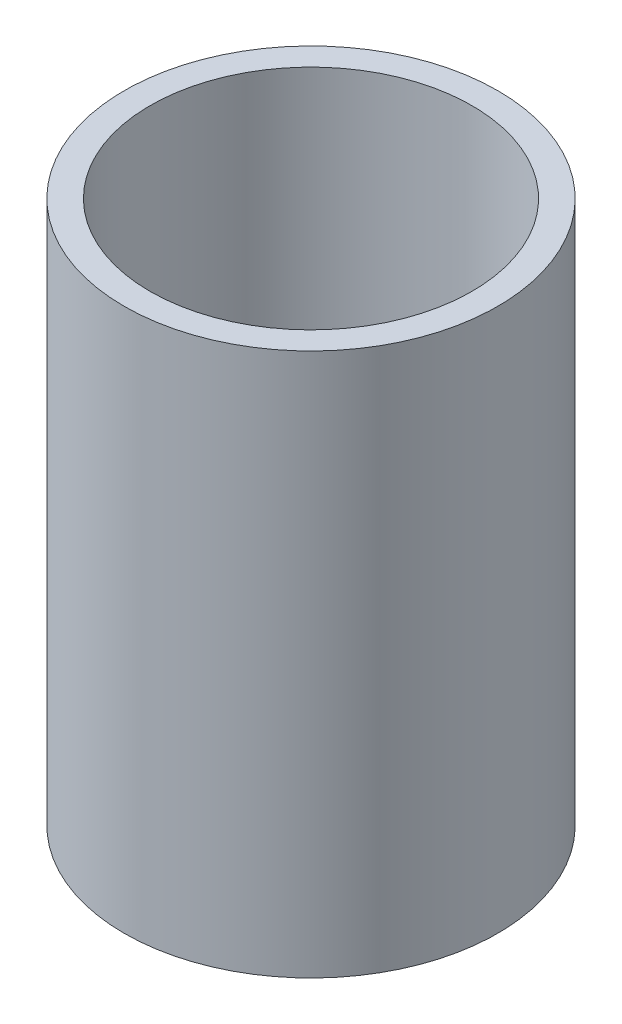
ISO-10303-21;
HEADER;
FILE_DESCRIPTION(('STEP AP214'),'2;1');
FILE_NAME('part.step','',(''),(''),'','','');
FILE_SCHEMA(('AUTOMOTIVE_DESIGN { 1 0 10303 214 1 1 1 1 }'));
ENDSEC;
DATA;
#1=APPLICATION_CONTEXT('core data for automotive mechanical design processes');
#2=APPLICATION_PROTOCOL_DEFINITION('international standard','automotive_design',2000,#1);
#3=PRODUCT_CONTEXT('',#1,'mechanical');
#4=PRODUCT('Part','Part','',(#3));
#5=PRODUCT_RELATED_PRODUCT_CATEGORY('part','',(#4));
#6=PRODUCT_DEFINITION_FORMATION('','',#4);
#7=PRODUCT_DEFINITION_CONTEXT('part definition',#1,'design');
#8=PRODUCT_DEFINITION('design','',#6,#7);
#9=PRODUCT_DEFINITION_SHAPE('','',#8);
#10=(LENGTH_UNIT() NAMED_UNIT(*) SI_UNIT(.MILLI.,.METRE.));
#11=(NAMED_UNIT(*) PLANE_ANGLE_UNIT() SI_UNIT($,.RADIAN.));
#12=(NAMED_UNIT(*) SI_UNIT($,.STERADIAN.) SOLID_ANGLE_UNIT());
#13=UNCERTAINTY_MEASURE_WITH_UNIT(LENGTH_MEASURE(1.E-05),#10,'distance_accuracy_value','');
#14=(GEOMETRIC_REPRESENTATION_CONTEXT(3) GLOBAL_UNCERTAINTY_ASSIGNED_CONTEXT((#13)) GLOBAL_UNIT_ASSIGNED_CONTEXT((#10,
#11,#12)) REPRESENTATION_CONTEXT('',''));
#15=CARTESIAN_POINT('',(0.,0.,0.));
#16=DIRECTION('',(0.,0.,1.));
#17=DIRECTION('',(1.,0.,0.));
#18=AXIS2_PLACEMENT_3D('',#15,#16,#17);
#19=CARTESIAN_POINT('',(0.,55.,0.));
#20=DIRECTION('',(0.,1.,0.));
#21=DIRECTION('',(0.,0.,1.));
#22=AXIS2_PLACEMENT_3D('',#19,#20,#21);
#23=CYLINDRICAL_SURFACE('',#22,45.8724);
#24=CARTESIAN_POINT('',(0.,-87.732365567385,0.));
#25=DIRECTION('',(0.,1.,0.));
#26=DIRECTION('',(0.,0.,1.));
#27=AXIS2_PLACEMENT_3D('',#24,#25,#26);
#28=CIRCLE('',#27,45.8724);
#29=CARTESIAN_POINT('',(0.,-87.732365567385,45.8724));
#30=VERTEX_POINT('',#29);
#31=EDGE_CURVE('E10',#30,#30,#28,.T.);
#32=ORIENTED_EDGE('',*,*,#31,.T.);
#33=EDGE_LOOP('',(#32));
#34=FACE_BOUND('',#33,.T.);
#35=CARTESIAN_POINT('',(0.,45.6176344326149,0.));
#36=DIRECTION('',(0.,1.,0.));
#37=DIRECTION('',(0.,0.,1.));
#38=AXIS2_PLACEMENT_3D('',#35,#36,#37);
#39=CIRCLE('',#38,45.8724);
#40=CARTESIAN_POINT('',(0.,45.6176344326149,45.8724));
#41=VERTEX_POINT('',#40);
#42=EDGE_CURVE('E45',#41,#41,#39,.T.);
#43=ORIENTED_EDGE('',*,*,#42,.F.);
#44=EDGE_LOOP('',(#43));
#45=FACE_BOUND('',#44,.T.);
#46=ADVANCED_FACE('F31',(#34,#45),#23,.T.);
#47=CARTESIAN_POINT('',(-45.8724,-87.7323655673851,0.));
#48=DIRECTION('',(0.,-1.,0.));
#49=DIRECTION('',(0.,0.,-1.));
#50=AXIS2_PLACEMENT_3D('',#47,#48,#49);
#51=PLANE('',#50);
#52=CARTESIAN_POINT('',(0.,-87.732365567385,0.));
#53=DIRECTION('',(0.,1.,0.));
#54=DIRECTION('',(0.,0.,1.));
#55=AXIS2_PLACEMENT_3D('',#52,#53,#54);
#56=CIRCLE('',#55,39.5224);
#57=CARTESIAN_POINT('',(0.,-87.732365567385,39.5224));
#58=VERTEX_POINT('',#57);
#59=EDGE_CURVE('E37',#58,#58,#56,.T.);
#60=ORIENTED_EDGE('',*,*,#59,.T.);
#61=EDGE_LOOP('',(#60));
#62=FACE_BOUND('',#61,.T.);
#63=ORIENTED_EDGE('',*,*,#31,.F.);
#64=EDGE_LOOP('',(#63));
#65=FACE_BOUND('',#64,.T.);
#66=ADVANCED_FACE('F55',(#62,#65),#51,.T.);
#67=CARTESIAN_POINT('',(0.,55.,0.));
#68=DIRECTION('',(0.,1.,0.));
#69=DIRECTION('',(0.,0.,1.));
#70=AXIS2_PLACEMENT_3D('',#67,#68,#69);
#71=CYLINDRICAL_SURFACE('',#70,39.5224);
#72=CARTESIAN_POINT('',(0.,45.6176344326149,0.));
#73=DIRECTION('',(0.,1.,0.));
#74=DIRECTION('',(0.,0.,1.));
#75=AXIS2_PLACEMENT_3D('',#72,#73,#74);
#76=CIRCLE('',#75,39.5224);
#77=CARTESIAN_POINT('',(0.,45.6176344326149,39.5224));
#78=VERTEX_POINT('',#77);
#79=EDGE_CURVE('E41',#78,#78,#76,.T.);
#80=ORIENTED_EDGE('',*,*,#79,.T.);
#81=EDGE_LOOP('',(#80));
#82=FACE_BOUND('',#81,.T.);
#83=ORIENTED_EDGE('',*,*,#59,.F.);
#84=EDGE_LOOP('',(#83));
#85=FACE_BOUND('',#84,.T.);
#86=ADVANCED_FACE('F59',(#82,#85),#71,.F.);
#87=CARTESIAN_POINT('',(-45.8724,45.6176344326149,0.));
#88=DIRECTION('',(0.,1.,0.));
#89=DIRECTION('',(0.,0.,1.));
#90=AXIS2_PLACEMENT_3D('',#87,#88,#89);
#91=PLANE('',#90);
#92=ORIENTED_EDGE('',*,*,#42,.T.);
#93=EDGE_LOOP('',(#92));
#94=FACE_BOUND('',#93,.T.);
#95=ORIENTED_EDGE('',*,*,#79,.F.);
#96=EDGE_LOOP('',(#95));
#97=FACE_BOUND('',#96,.T.);
#98=ADVANCED_FACE('F51',(#94,#97),#91,.T.);
#99=CLOSED_SHELL('',(#46,#66,#86,#98));
#100=MANIFOLD_SOLID_BREP('B2',#99);
#101=ADVANCED_BREP_SHAPE_REPRESENTATION('',(#18,#100),#14);
#102=SHAPE_DEFINITION_REPRESENTATION(#9,#101);
ENDSEC;
END-ISO-10303-21;
